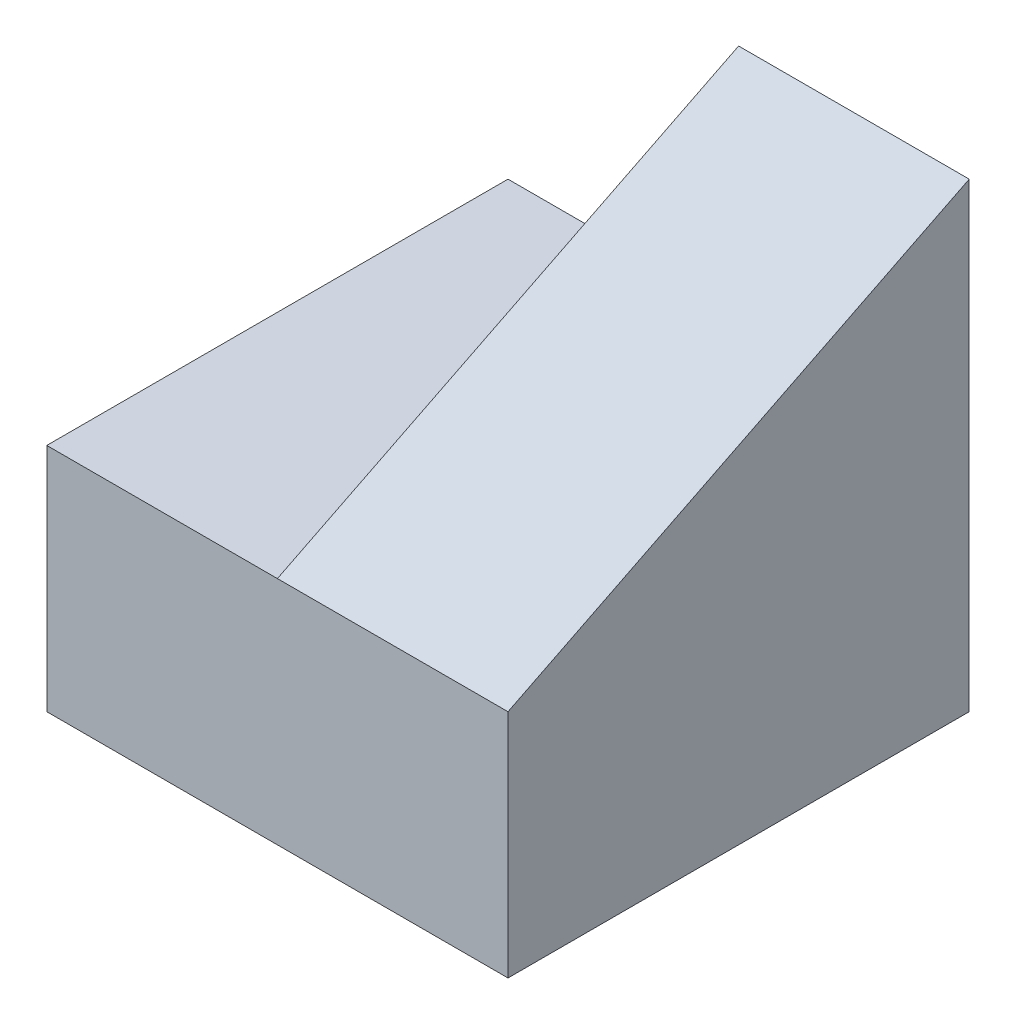
ISO-10303-21;
HEADER;
FILE_DESCRIPTION(('STEP AP214'),'2;1');
FILE_NAME('part.step','',(''),(''),'','','');
FILE_SCHEMA(('AUTOMOTIVE_DESIGN { 1 0 10303 214 1 1 1 1 }'));
ENDSEC;
DATA;
#1=APPLICATION_CONTEXT('core data for automotive mechanical design processes');
#2=APPLICATION_PROTOCOL_DEFINITION('international standard','automotive_design',2000,#1);
#3=PRODUCT_CONTEXT('',#1,'mechanical');
#4=PRODUCT('Part','Part','',(#3));
#5=PRODUCT_RELATED_PRODUCT_CATEGORY('part','',(#4));
#6=PRODUCT_DEFINITION_FORMATION('','',#4);
#7=PRODUCT_DEFINITION_CONTEXT('part definition',#1,'design');
#8=PRODUCT_DEFINITION('design','',#6,#7);
#9=PRODUCT_DEFINITION_SHAPE('','',#8);
#10=(LENGTH_UNIT() NAMED_UNIT(*) SI_UNIT(.MILLI.,.METRE.));
#11=(NAMED_UNIT(*) PLANE_ANGLE_UNIT() SI_UNIT($,.RADIAN.));
#12=(NAMED_UNIT(*) SI_UNIT($,.STERADIAN.) SOLID_ANGLE_UNIT());
#13=UNCERTAINTY_MEASURE_WITH_UNIT(LENGTH_MEASURE(1.E-05),#10,'distance_accuracy_value','');
#14=(GEOMETRIC_REPRESENTATION_CONTEXT(3) GLOBAL_UNCERTAINTY_ASSIGNED_CONTEXT((#13)) GLOBAL_UNIT_ASSIGNED_CONTEXT((#10,
#11,#12)) REPRESENTATION_CONTEXT('',''));
#15=CARTESIAN_POINT('',(0.,0.,0.));
#16=DIRECTION('',(0.,0.,1.));
#17=DIRECTION('',(1.,0.,0.));
#18=AXIS2_PLACEMENT_3D('',#15,#16,#17);
#19=CARTESIAN_POINT('',(0.,0.,40.));
#20=DIRECTION('',(1.,0.,0.));
#21=DIRECTION('',(0.,0.,-1.));
#22=AXIS2_PLACEMENT_3D('',#19,#20,#21);
#23=PLANE('',#22);
#24=DIRECTION('',(0.,-1.,0.));
#25=VECTOR('',#24,1.);
#26=CARTESIAN_POINT('',(0.,0.,0.));
#27=LINE('',#26,#25);
#28=CARTESIAN_POINT('',(0.,20.,0.));
#29=VERTEX_POINT('',#28);
#30=CARTESIAN_POINT('',(0.,0.,0.));
#31=VERTEX_POINT('',#30);
#32=EDGE_CURVE('E122',#29,#31,#27,.T.);
#33=ORIENTED_EDGE('',*,*,#32,.T.);
#34=DIRECTION('',(0.,0.,-1.));
#35=VECTOR('',#34,1.);
#36=CARTESIAN_POINT('',(0.,0.,40.));
#37=LINE('',#36,#35);
#38=CARTESIAN_POINT('',(0.,0.,40.));
#39=VERTEX_POINT('',#38);
#40=EDGE_CURVE('E11',#39,#31,#37,.T.);
#41=ORIENTED_EDGE('',*,*,#40,.F.);
#42=DIRECTION('',(0.,-1.,0.));
#43=VECTOR('',#42,1.);
#44=CARTESIAN_POINT('',(0.,0.,40.));
#45=LINE('',#44,#43);
#46=CARTESIAN_POINT('',(0.,20.,40.));
#47=VERTEX_POINT('',#46);
#48=EDGE_CURVE('E132',#47,#39,#45,.T.);
#49=ORIENTED_EDGE('',*,*,#48,.F.);
#50=DIRECTION('',(0.,0.,-1.));
#51=VECTOR('',#50,1.);
#52=CARTESIAN_POINT('',(0.,20.,40.));
#53=LINE('',#52,#51);
#54=EDGE_CURVE('E105',#47,#29,#53,.T.);
#55=ORIENTED_EDGE('',*,*,#54,.T.);
#56=EDGE_LOOP('',(#33,#41,#49,#55));
#57=FACE_BOUND('',#56,.T.);
#58=ADVANCED_FACE('F33',(#57),#23,.F.);
#59=CARTESIAN_POINT('',(0.,0.,40.));
#60=DIRECTION('',(0.,1.,0.));
#61=DIRECTION('',(0.,0.,1.));
#62=AXIS2_PLACEMENT_3D('',#59,#60,#61);
#63=PLANE('',#62);
#64=DIRECTION('',(1.,0.,0.));
#65=VECTOR('',#64,1.);
#66=CARTESIAN_POINT('',(0.,0.,0.));
#67=LINE('',#66,#65);
#68=CARTESIAN_POINT('',(40.,0.,0.));
#69=VERTEX_POINT('',#68);
#70=EDGE_CURVE('E126',#31,#69,#67,.T.);
#71=ORIENTED_EDGE('',*,*,#70,.T.);
#72=DIRECTION('',(0.,0.,-1.));
#73=VECTOR('',#72,1.);
#74=CARTESIAN_POINT('',(40.,0.,40.));
#75=LINE('',#74,#73);
#76=CARTESIAN_POINT('',(40.,0.,40.));
#77=VERTEX_POINT('',#76);
#78=EDGE_CURVE('E41',#77,#69,#75,.T.);
#79=ORIENTED_EDGE('',*,*,#78,.F.);
#80=DIRECTION('',(1.,0.,0.));
#81=VECTOR('',#80,1.);
#82=CARTESIAN_POINT('',(0.,0.,40.));
#83=LINE('',#82,#81);
#84=EDGE_CURVE('E80',#39,#77,#83,.T.);
#85=ORIENTED_EDGE('',*,*,#84,.F.);
#86=ORIENTED_EDGE('',*,*,#40,.T.);
#87=EDGE_LOOP('',(#71,#79,#85,#86));
#88=FACE_BOUND('',#87,.T.);
#89=ADVANCED_FACE('F147',(#88),#63,.F.);
#90=CARTESIAN_POINT('',(40.,0.,40.));
#91=DIRECTION('',(-1.,0.,0.));
#92=DIRECTION('',(0.,0.,1.));
#93=AXIS2_PLACEMENT_3D('',#90,#91,#92);
#94=PLANE('',#93);
#95=DIRECTION('',(0.,1.,0.));
#96=VECTOR('',#95,1.);
#97=CARTESIAN_POINT('',(40.,0.,0.));
#98=LINE('',#97,#96);
#99=CARTESIAN_POINT('',(40.,40.,0.));
#100=VERTEX_POINT('',#99);
#101=EDGE_CURVE('E128',#69,#100,#98,.T.);
#102=ORIENTED_EDGE('',*,*,#101,.T.);
#103=DIRECTION('',(0.,-0.447213595499958,0.894427190999916));
#104=VECTOR('',#103,1.);
#105=CARTESIAN_POINT('',(40.,40.,0.));
#106=LINE('',#105,#104);
#107=CARTESIAN_POINT('',(40.,20.,40.));
#108=VERTEX_POINT('',#107);
#109=EDGE_CURVE('E103',#100,#108,#106,.T.);
#110=ORIENTED_EDGE('',*,*,#109,.T.);
#111=DIRECTION('',(0.,1.,0.));
#112=VECTOR('',#111,1.);
#113=CARTESIAN_POINT('',(40.,0.,40.));
#114=LINE('',#113,#112);
#115=EDGE_CURVE('E107',#77,#108,#114,.T.);
#116=ORIENTED_EDGE('',*,*,#115,.F.);
#117=ORIENTED_EDGE('',*,*,#78,.T.);
#118=EDGE_LOOP('',(#102,#110,#116,#117));
#119=FACE_BOUND('',#118,.T.);
#120=ADVANCED_FACE('F136',(#119),#94,.F.);
#121=CARTESIAN_POINT('',(0.,20.,40.));
#122=DIRECTION('',(0.,-1.,0.));
#123=DIRECTION('',(0.,0.,-1.));
#124=AXIS2_PLACEMENT_3D('',#121,#122,#123);
#125=PLANE('',#124);
#126=DIRECTION('',(-1.,0.,0.));
#127=VECTOR('',#126,1.);
#128=CARTESIAN_POINT('',(0.,20.,40.));
#129=LINE('',#128,#127);
#130=CARTESIAN_POINT('',(20.,20.,40.));
#131=VERTEX_POINT('',#130);
#132=EDGE_CURVE('E58',#131,#47,#129,.T.);
#133=ORIENTED_EDGE('',*,*,#132,.F.);
#134=DIRECTION('',(0.,0.,-1.));
#135=VECTOR('',#134,1.);
#136=CARTESIAN_POINT('',(20.,20.,40.));
#137=LINE('',#136,#135);
#138=CARTESIAN_POINT('',(20.,20.,0.));
#139=VERTEX_POINT('',#138);
#140=EDGE_CURVE('E91',#131,#139,#137,.T.);
#141=ORIENTED_EDGE('',*,*,#140,.T.);
#142=DIRECTION('',(-1.,0.,0.));
#143=VECTOR('',#142,1.);
#144=CARTESIAN_POINT('',(0.,20.,0.));
#145=LINE('',#144,#143);
#146=EDGE_CURVE('E75',#139,#29,#145,.T.);
#147=ORIENTED_EDGE('',*,*,#146,.T.);
#148=ORIENTED_EDGE('',*,*,#54,.F.);
#149=EDGE_LOOP('',(#133,#141,#147,#148));
#150=FACE_BOUND('',#149,.T.);
#151=ADVANCED_FACE('F104',(#150),#125,.F.);
#152=CARTESIAN_POINT('',(0.,0.,40.));
#153=DIRECTION('',(0.,0.,-1.));
#154=DIRECTION('',(-1.,0.,0.));
#155=AXIS2_PLACEMENT_3D('',#152,#153,#154);
#156=PLANE('',#155);
#157=ORIENTED_EDGE('',*,*,#48,.T.);
#158=ORIENTED_EDGE('',*,*,#84,.T.);
#159=ORIENTED_EDGE('',*,*,#115,.T.);
#160=EDGE_CURVE('E99',#108,#131,#129,.T.);
#161=ORIENTED_EDGE('',*,*,#160,.T.);
#162=ORIENTED_EDGE('',*,*,#132,.T.);
#163=EDGE_LOOP('',(#157,#158,#159,#161,#162));
#164=FACE_BOUND('',#163,.T.);
#165=ADVANCED_FACE('F110',(#164),#156,.F.);
#166=CARTESIAN_POINT('',(0.,0.,0.));
#167=DIRECTION('',(0.,0.,-1.));
#168=DIRECTION('',(-1.,0.,0.));
#169=AXIS2_PLACEMENT_3D('',#166,#167,#168);
#170=PLANE('',#169);
#171=ORIENTED_EDGE('',*,*,#32,.F.);
#172=ORIENTED_EDGE('',*,*,#146,.F.);
#173=DIRECTION('',(0.,1.,0.));
#174=VECTOR('',#173,1.);
#175=CARTESIAN_POINT('',(20.,20.,0.));
#176=LINE('',#175,#174);
#177=CARTESIAN_POINT('',(20.,40.,0.));
#178=VERTEX_POINT('',#177);
#179=EDGE_CURVE('E49',#139,#178,#176,.T.);
#180=ORIENTED_EDGE('',*,*,#179,.T.);
#181=DIRECTION('',(1.,0.,0.));
#182=VECTOR('',#181,1.);
#183=CARTESIAN_POINT('',(20.,40.,0.));
#184=LINE('',#183,#182);
#185=EDGE_CURVE('E102',#178,#100,#184,.T.);
#186=ORIENTED_EDGE('',*,*,#185,.T.);
#187=ORIENTED_EDGE('',*,*,#101,.F.);
#188=ORIENTED_EDGE('',*,*,#70,.F.);
#189=EDGE_LOOP('',(#171,#172,#180,#186,#187,#188));
#190=FACE_BOUND('',#189,.T.);
#191=ADVANCED_FACE('F139',(#190),#170,.T.);
#192=CARTESIAN_POINT('',(20.,40.,0.));
#193=DIRECTION('',(0.,0.894427190999916,0.447213595499958));
#194=DIRECTION('',(0.,-0.447213595499958,0.894427190999916));
#195=AXIS2_PLACEMENT_3D('',#192,#193,#194);
#196=PLANE('',#195);
#197=ORIENTED_EDGE('',*,*,#109,.F.);
#198=ORIENTED_EDGE('',*,*,#185,.F.);
#199=DIRECTION('',(0.,-0.447213595499958,0.894427190999916));
#200=VECTOR('',#199,1.);
#201=CARTESIAN_POINT('',(20.,40.,0.));
#202=LINE('',#201,#200);
#203=EDGE_CURVE('E94',#178,#131,#202,.T.);
#204=ORIENTED_EDGE('',*,*,#203,.T.);
#205=ORIENTED_EDGE('',*,*,#160,.F.);
#206=EDGE_LOOP('',(#197,#198,#204,#205));
#207=FACE_BOUND('',#206,.T.);
#208=ADVANCED_FACE('F98',(#207),#196,.T.);
#209=CARTESIAN_POINT('',(20.,0.,0.));
#210=DIRECTION('',(-1.,0.,0.));
#211=DIRECTION('',(0.,0.,1.));
#212=AXIS2_PLACEMENT_3D('',#209,#210,#211);
#213=PLANE('',#212);
#214=ORIENTED_EDGE('',*,*,#203,.F.);
#215=ORIENTED_EDGE('',*,*,#179,.F.);
#216=ORIENTED_EDGE('',*,*,#140,.F.);
#217=EDGE_LOOP('',(#214,#215,#216));
#218=FACE_BOUND('',#217,.T.);
#219=ADVANCED_FACE('F93',(#218),#213,.T.);
#220=CLOSED_SHELL('',(#58,#89,#120,#151,#165,#191,#208,#219));
#221=MANIFOLD_SOLID_BREP('B2',#220);
#222=ADVANCED_BREP_SHAPE_REPRESENTATION('',(#18,#221),#14);
#223=SHAPE_DEFINITION_REPRESENTATION(#9,#222);
ENDSEC;
END-ISO-10303-21;
